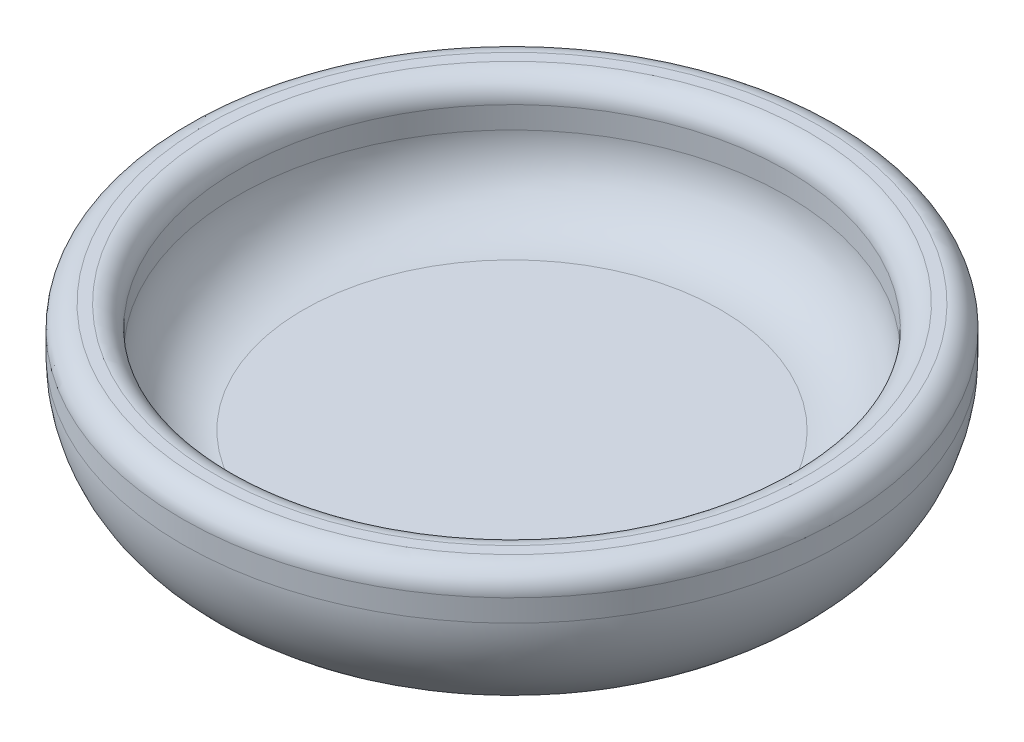
ISO-10303-21;
HEADER;
FILE_DESCRIPTION(('STEP AP214'),'2;1');
FILE_NAME('part.step','',(''),(''),'','','');
FILE_SCHEMA(('AUTOMOTIVE_DESIGN { 1 0 10303 214 1 1 1 1 }'));
ENDSEC;
DATA;
#1=APPLICATION_CONTEXT('core data for automotive mechanical design processes');
#2=APPLICATION_PROTOCOL_DEFINITION('international standard','automotive_design',2000,#1);
#3=PRODUCT_CONTEXT('',#1,'mechanical');
#4=PRODUCT('Part','Part','',(#3));
#5=PRODUCT_RELATED_PRODUCT_CATEGORY('part','',(#4));
#6=PRODUCT_DEFINITION_FORMATION('','',#4);
#7=PRODUCT_DEFINITION_CONTEXT('part definition',#1,'design');
#8=PRODUCT_DEFINITION('design','',#6,#7);
#9=PRODUCT_DEFINITION_SHAPE('','',#8);
#10=(LENGTH_UNIT() NAMED_UNIT(*) SI_UNIT(.MILLI.,.METRE.));
#11=(NAMED_UNIT(*) PLANE_ANGLE_UNIT() SI_UNIT($,.RADIAN.));
#12=(NAMED_UNIT(*) SI_UNIT($,.STERADIAN.) SOLID_ANGLE_UNIT());
#13=UNCERTAINTY_MEASURE_WITH_UNIT(LENGTH_MEASURE(1.E-05),#10,'distance_accuracy_value','');
#14=(GEOMETRIC_REPRESENTATION_CONTEXT(3) GLOBAL_UNCERTAINTY_ASSIGNED_CONTEXT((#13)) GLOBAL_UNIT_ASSIGNED_CONTEXT((#10,
#11,#12)) REPRESENTATION_CONTEXT('',''));
#15=CARTESIAN_POINT('',(0.,0.,0.));
#16=DIRECTION('',(0.,0.,1.));
#17=DIRECTION('',(1.,0.,0.));
#18=AXIS2_PLACEMENT_3D('',#15,#16,#17);
#19=CARTESIAN_POINT('',(24.13,0.,0.));
#20=DIRECTION('',(0.,-1.,0.));
#21=DIRECTION('',(0.,0.,-1.));
#22=AXIS2_PLACEMENT_3D('',#19,#20,#21);
#23=PLANE('',#22);
#24=CARTESIAN_POINT('',(0.,0.,0.));
#25=DIRECTION('',(0.,-1.,0.));
#26=DIRECTION('',(0.,0.,-1.));
#27=AXIS2_PLACEMENT_3D('',#24,#25,#26);
#28=CIRCLE('',#27,24.13);
#29=CARTESIAN_POINT('',(0.,0.,-24.13));
#30=VERTEX_POINT('',#29);
#31=EDGE_CURVE('E10',#30,#30,#28,.T.);
#32=ORIENTED_EDGE('',*,*,#31,.T.);
#33=EDGE_LOOP('',(#32));
#34=FACE_BOUND('',#33,.T.);
#35=ADVANCED_FACE('F31',(#34),#23,.T.);
#36=CARTESIAN_POINT('',(0.,13.97,0.));
#37=DIRECTION('',(0.,-1.,0.));
#38=DIRECTION('',(0.,0.,-1.));
#39=AXIS2_PLACEMENT_3D('',#36,#37,#38);
#40=TOROIDAL_SURFACE('',#39,24.13,13.97);
#41=CARTESIAN_POINT('',(0.,13.97,0.));
#42=DIRECTION('',(0.,-1.,0.));
#43=DIRECTION('',(0.,0.,-1.));
#44=AXIS2_PLACEMENT_3D('',#41,#42,#43);
#45=CIRCLE('',#44,38.1);
#46=CARTESIAN_POINT('',(0.,13.97,-38.1));
#47=VERTEX_POINT('',#46);
#48=EDGE_CURVE('E37',#47,#47,#45,.T.);
#49=ORIENTED_EDGE('',*,*,#48,.T.);
#50=EDGE_LOOP('',(#49));
#51=FACE_BOUND('',#50,.T.);
#52=ORIENTED_EDGE('',*,*,#31,.F.);
#53=EDGE_LOOP('',(#52));
#54=FACE_BOUND('',#53,.T.);
#55=ADVANCED_FACE('F75',(#51,#54),#40,.T.);
#56=CARTESIAN_POINT('',(0.,0.,0.));
#57=DIRECTION('',(0.,-1.,0.));
#58=DIRECTION('',(0.,0.,-1.));
#59=AXIS2_PLACEMENT_3D('',#56,#57,#58);
#60=CYLINDRICAL_SURFACE('',#59,38.1);
#61=CARTESIAN_POINT('',(0.,16.51,0.));
#62=DIRECTION('',(0.,-1.,0.));
#63=DIRECTION('',(0.,0.,-1.));
#64=AXIS2_PLACEMENT_3D('',#61,#62,#63);
#65=CIRCLE('',#64,38.1);
#66=CARTESIAN_POINT('',(0.,16.51,-38.1));
#67=VERTEX_POINT('',#66);
#68=EDGE_CURVE('E41',#67,#67,#65,.T.);
#69=ORIENTED_EDGE('',*,*,#68,.T.);
#70=EDGE_LOOP('',(#69));
#71=FACE_BOUND('',#70,.T.);
#72=ORIENTED_EDGE('',*,*,#48,.F.);
#73=EDGE_LOOP('',(#72));
#74=FACE_BOUND('',#73,.T.);
#75=ADVANCED_FACE('F79',(#71,#74),#60,.T.);
#76=CARTESIAN_POINT('',(0.,16.51,0.));
#77=DIRECTION('',(0.,-1.,0.));
#78=DIRECTION('',(0.,0.,-1.));
#79=AXIS2_PLACEMENT_3D('',#76,#77,#78);
#80=TOROIDAL_SURFACE('',#79,35.56,2.54);
#81=CARTESIAN_POINT('',(0.,19.05,0.));
#82=DIRECTION('',(0.,-1.,0.));
#83=DIRECTION('',(0.,0.,-1.));
#84=AXIS2_PLACEMENT_3D('',#81,#82,#83);
#85=CIRCLE('',#84,35.56);
#86=CARTESIAN_POINT('',(0.,19.05,-35.56));
#87=VERTEX_POINT('',#86);
#88=EDGE_CURVE('E45',#87,#87,#85,.T.);
#89=ORIENTED_EDGE('',*,*,#88,.T.);
#90=EDGE_LOOP('',(#89));
#91=FACE_BOUND('',#90,.T.);
#92=ORIENTED_EDGE('',*,*,#68,.F.);
#93=EDGE_LOOP('',(#92));
#94=FACE_BOUND('',#93,.T.);
#95=ADVANCED_FACE('F83',(#91,#94),#80,.T.);
#96=CARTESIAN_POINT('',(34.29,19.05,0.));
#97=DIRECTION('',(0.,1.,0.));
#98=DIRECTION('',(0.,0.,1.));
#99=AXIS2_PLACEMENT_3D('',#96,#97,#98);
#100=PLANE('',#99);
#101=CARTESIAN_POINT('',(0.,19.05,0.));
#102=DIRECTION('',(0.,-1.,0.));
#103=DIRECTION('',(0.,0.,-1.));
#104=AXIS2_PLACEMENT_3D('',#101,#102,#103);
#105=CIRCLE('',#104,34.29);
#106=CARTESIAN_POINT('',(0.,19.05,-34.29));
#107=VERTEX_POINT('',#106);
#108=EDGE_CURVE('E50',#107,#107,#105,.T.);
#109=ORIENTED_EDGE('',*,*,#108,.T.);
#110=EDGE_LOOP('',(#109));
#111=FACE_BOUND('',#110,.T.);
#112=ORIENTED_EDGE('',*,*,#88,.F.);
#113=EDGE_LOOP('',(#112));
#114=FACE_BOUND('',#113,.T.);
#115=ADVANCED_FACE('F90',(#111,#114),#100,.T.);
#116=CARTESIAN_POINT('',(0.,16.51,0.));
#117=DIRECTION('',(0.,-1.,0.));
#118=DIRECTION('',(0.,0.,-1.));
#119=AXIS2_PLACEMENT_3D('',#116,#117,#118);
#120=TOROIDAL_SURFACE('',#119,34.29,2.54);
#121=CARTESIAN_POINT('',(0.,16.51,0.));
#122=DIRECTION('',(0.,-1.,0.));
#123=DIRECTION('',(0.,0.,-1.));
#124=AXIS2_PLACEMENT_3D('',#121,#122,#123);
#125=CIRCLE('',#124,31.75);
#126=CARTESIAN_POINT('',(0.,16.51,-31.75));
#127=VERTEX_POINT('',#126);
#128=EDGE_CURVE('E53',#127,#127,#125,.T.);
#129=ORIENTED_EDGE('',*,*,#128,.T.);
#130=EDGE_LOOP('',(#129));
#131=FACE_BOUND('',#130,.T.);
#132=ORIENTED_EDGE('',*,*,#108,.F.);
#133=EDGE_LOOP('',(#132));
#134=FACE_BOUND('',#133,.T.);
#135=ADVANCED_FACE('F94',(#131,#134),#120,.T.);
#136=CARTESIAN_POINT('',(0.,0.,0.));
#137=DIRECTION('',(0.,-1.,0.));
#138=DIRECTION('',(0.,0.,-1.));
#139=AXIS2_PLACEMENT_3D('',#136,#137,#138);
#140=CYLINDRICAL_SURFACE('',#139,31.75);
#141=CARTESIAN_POINT('',(0.,13.97,0.));
#142=DIRECTION('',(0.,-1.,0.));
#143=DIRECTION('',(0.,0.,-1.));
#144=AXIS2_PLACEMENT_3D('',#141,#142,#143);
#145=CIRCLE('',#144,31.75);
#146=CARTESIAN_POINT('',(0.,13.97,-31.75));
#147=VERTEX_POINT('',#146);
#148=EDGE_CURVE('E56',#147,#147,#145,.T.);
#149=ORIENTED_EDGE('',*,*,#148,.T.);
#150=EDGE_LOOP('',(#149));
#151=FACE_BOUND('',#150,.T.);
#152=ORIENTED_EDGE('',*,*,#128,.F.);
#153=EDGE_LOOP('',(#152));
#154=FACE_BOUND('',#153,.T.);
#155=ADVANCED_FACE('F72',(#151,#154),#140,.F.);
#156=CARTESIAN_POINT('',(0.,13.97,0.));
#157=DIRECTION('',(0.,-1.,0.));
#158=DIRECTION('',(0.,0.,-1.));
#159=AXIS2_PLACEMENT_3D('',#156,#157,#158);
#160=TOROIDAL_SURFACE('',#159,24.13,7.62);
#161=CARTESIAN_POINT('',(0.,6.35,0.));
#162=DIRECTION('',(0.,-1.,0.));
#163=DIRECTION('',(0.,0.,-1.));
#164=AXIS2_PLACEMENT_3D('',#161,#162,#163);
#165=CIRCLE('',#164,24.13);
#166=CARTESIAN_POINT('',(0.,6.35,-24.13));
#167=VERTEX_POINT('',#166);
#168=EDGE_CURVE('E59',#167,#167,#165,.T.);
#169=ORIENTED_EDGE('',*,*,#168,.T.);
#170=EDGE_LOOP('',(#169));
#171=FACE_BOUND('',#170,.T.);
#172=ORIENTED_EDGE('',*,*,#148,.F.);
#173=EDGE_LOOP('',(#172));
#174=FACE_BOUND('',#173,.T.);
#175=ADVANCED_FACE('F63',(#171,#174),#160,.F.);
#176=CARTESIAN_POINT('',(0.,6.35,0.));
#177=DIRECTION('',(0.,1.,0.));
#178=DIRECTION('',(0.,0.,1.));
#179=AXIS2_PLACEMENT_3D('',#176,#177,#178);
#180=PLANE('',#179);
#181=ORIENTED_EDGE('',*,*,#168,.F.);
#182=EDGE_LOOP('',(#181));
#183=FACE_BOUND('',#182,.T.);
#184=ADVANCED_FACE('F66',(#183),#180,.T.);
#185=CLOSED_SHELL('',(#35,#55,#75,#95,#115,#135,#155,#175,#184));
#186=MANIFOLD_SOLID_BREP('B2',#185);
#187=ADVANCED_BREP_SHAPE_REPRESENTATION('',(#18,#186),#14);
#188=SHAPE_DEFINITION_REPRESENTATION(#9,#187);
ENDSEC;
END-ISO-10303-21;
